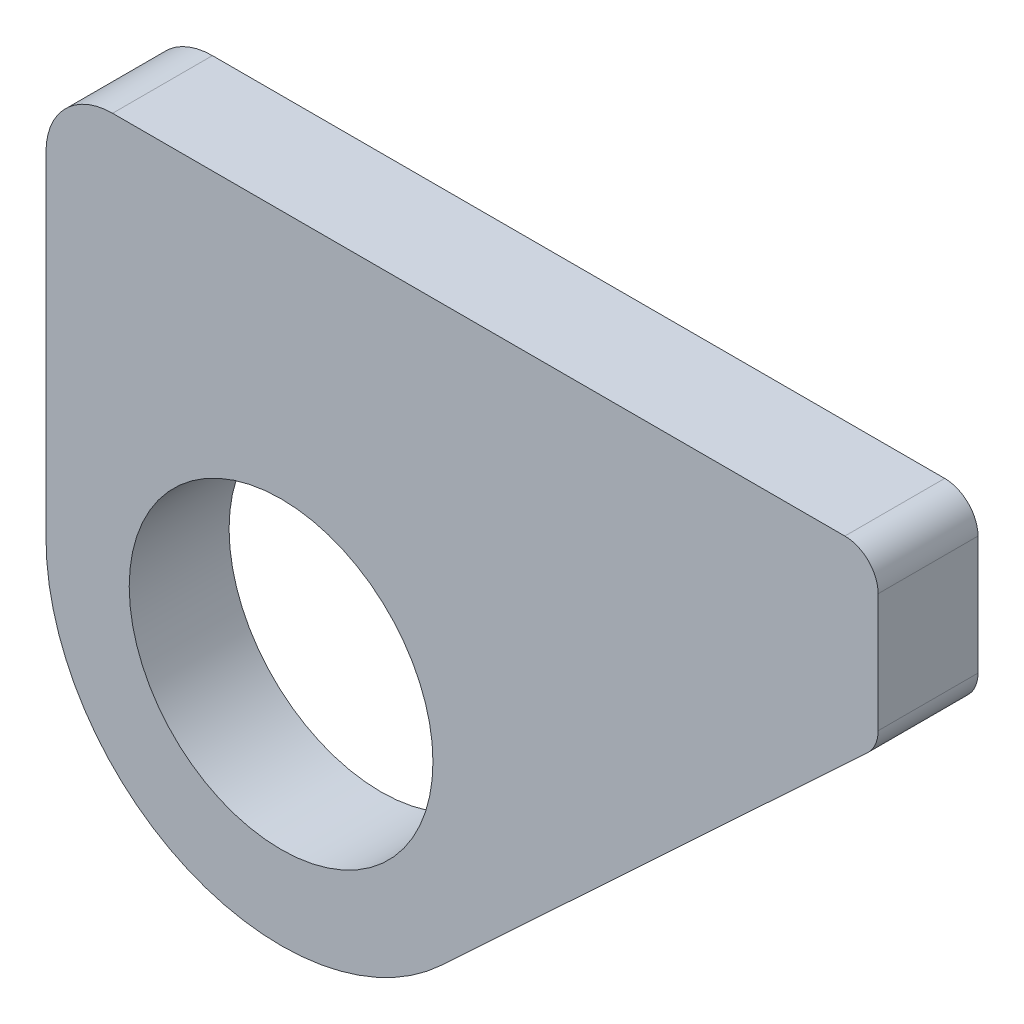
ISO-10303-21;
HEADER;
FILE_DESCRIPTION(('STEP AP214'),'2;1');
FILE_NAME('part.step','',(''),(''),'','','');
FILE_SCHEMA(('AUTOMOTIVE_DESIGN { 1 0 10303 214 1 1 1 1 }'));
ENDSEC;
DATA;
#1=APPLICATION_CONTEXT('core data for automotive mechanical design processes');
#2=APPLICATION_PROTOCOL_DEFINITION('international standard','automotive_design',2000,#1);
#3=PRODUCT_CONTEXT('',#1,'mechanical');
#4=PRODUCT('Part','Part','',(#3));
#5=PRODUCT_RELATED_PRODUCT_CATEGORY('part','',(#4));
#6=PRODUCT_DEFINITION_FORMATION('','',#4);
#7=PRODUCT_DEFINITION_CONTEXT('part definition',#1,'design');
#8=PRODUCT_DEFINITION('design','',#6,#7);
#9=PRODUCT_DEFINITION_SHAPE('','',#8);
#10=(LENGTH_UNIT() NAMED_UNIT(*) SI_UNIT(.MILLI.,.METRE.));
#11=(NAMED_UNIT(*) PLANE_ANGLE_UNIT() SI_UNIT($,.RADIAN.));
#12=(NAMED_UNIT(*) SI_UNIT($,.STERADIAN.) SOLID_ANGLE_UNIT());
#13=UNCERTAINTY_MEASURE_WITH_UNIT(LENGTH_MEASURE(1.E-05),#10,'distance_accuracy_value','');
#14=(GEOMETRIC_REPRESENTATION_CONTEXT(3) GLOBAL_UNCERTAINTY_ASSIGNED_CONTEXT((#13)) GLOBAL_UNIT_ASSIGNED_CONTEXT((#10,
#11,#12)) REPRESENTATION_CONTEXT('',''));
#15=CARTESIAN_POINT('',(0.,0.,0.));
#16=DIRECTION('',(0.,0.,1.));
#17=DIRECTION('',(1.,0.,0.));
#18=AXIS2_PLACEMENT_3D('',#15,#16,#17);
#19=CARTESIAN_POINT('',(108.051164310717,0.,3.));
#20=DIRECTION('',(-1.,0.,0.));
#21=DIRECTION('',(0.,0.,1.));
#22=AXIS2_PLACEMENT_3D('',#19,#20,#21);
#23=PLANE('',#22);
#24=DIRECTION('',(0.,1.,0.));
#25=VECTOR('',#24,1.);
#26=CARTESIAN_POINT('',(108.051164310717,0.,3.));
#27=LINE('',#26,#25);
#28=CARTESIAN_POINT('',(108.051164310717,46.3379588594764,3.));
#29=VERTEX_POINT('',#28);
#30=CARTESIAN_POINT('',(108.051164310717,56.4004588594764,3.));
#31=VERTEX_POINT('',#30);
#32=EDGE_CURVE('E114',#29,#31,#27,.T.);
#33=ORIENTED_EDGE('',*,*,#32,.T.);
#34=DIRECTION('',(0.,0.,-1.));
#35=VECTOR('',#34,1.);
#36=CARTESIAN_POINT('',(108.051164310717,56.4004588594764,3.));
#37=LINE('',#36,#35);
#38=CARTESIAN_POINT('',(108.051164310717,56.4004588594764,0.));
#39=VERTEX_POINT('',#38);
#40=EDGE_CURVE('E122',#31,#39,#37,.T.);
#41=ORIENTED_EDGE('',*,*,#40,.T.);
#42=DIRECTION('',(0.,1.,0.));
#43=VECTOR('',#42,1.);
#44=CARTESIAN_POINT('',(108.051164310717,0.,0.));
#45=LINE('',#44,#43);
#46=CARTESIAN_POINT('',(108.051164310717,46.3379588594764,0.));
#47=VERTEX_POINT('',#46);
#48=EDGE_CURVE('E117',#47,#39,#45,.T.);
#49=ORIENTED_EDGE('',*,*,#48,.F.);
#50=DIRECTION('',(0.,0.,-1.));
#51=VECTOR('',#50,1.);
#52=CARTESIAN_POINT('',(108.051164310717,46.3379588594764,3.));
#53=LINE('',#52,#51);
#54=EDGE_CURVE('E110',#29,#47,#53,.T.);
#55=ORIENTED_EDGE('',*,*,#54,.F.);
#56=EDGE_LOOP('',(#33,#41,#49,#55));
#57=FACE_BOUND('',#56,.T.);
#58=ADVANCED_FACE('F41',(#57),#23,.T.);
#59=CARTESIAN_POINT('',(115.113664310717,46.3379588594764,3.));
#60=DIRECTION('',(0.,0.,-1.));
#61=DIRECTION('',(-1.,0.,0.));
#62=AXIS2_PLACEMENT_3D('',#59,#60,#61);
#63=CYLINDRICAL_SURFACE('',#62,7.0625);
#64=CARTESIAN_POINT('',(115.113664310717,46.3379588594764,0.));
#65=DIRECTION('',(0.,0.,1.));
#66=DIRECTION('',(1.,0.,0.));
#67=AXIS2_PLACEMENT_3D('',#64,#65,#66);
#68=CIRCLE('',#67,7.0625);
#69=CARTESIAN_POINT('',(119.928647545597,41.1712536523036,0.));
#70=VERTEX_POINT('',#69);
#71=EDGE_CURVE('E160',#47,#70,#68,.T.);
#72=ORIENTED_EDGE('',*,*,#71,.T.);
#73=DIRECTION('',(0.,0.,-1.));
#74=VECTOR('',#73,1.);
#75=CARTESIAN_POINT('',(119.928647545597,41.1712536523036,3.));
#76=LINE('',#75,#74);
#77=CARTESIAN_POINT('',(119.928647545597,41.1712536523036,3.));
#78=VERTEX_POINT('',#77);
#79=EDGE_CURVE('E123',#78,#70,#76,.T.);
#80=ORIENTED_EDGE('',*,*,#79,.F.);
#81=CARTESIAN_POINT('',(115.113664310717,46.3379588594764,3.));
#82=DIRECTION('',(0.,0.,1.));
#83=DIRECTION('',(1.,0.,0.));
#84=AXIS2_PLACEMENT_3D('',#81,#82,#83);
#85=CIRCLE('',#84,7.0625);
#86=EDGE_CURVE('E127',#29,#78,#85,.T.);
#87=ORIENTED_EDGE('',*,*,#86,.F.);
#88=ORIENTED_EDGE('',*,*,#54,.T.);
#89=EDGE_LOOP('',(#72,#80,#87,#88));
#90=FACE_BOUND('',#89,.T.);
#91=ADVANCED_FACE('F128',(#90),#63,.T.);
#92=CARTESIAN_POINT('',(35.2091010356921,-37.781034073636,3.));
#93=DIRECTION('',(0.681767537682102,-0.731568878891717,0.));
#94=DIRECTION('',(0.731568878891717,0.681767537682102,0.));
#95=AXIS2_PLACEMENT_3D('',#92,#93,#94);
#96=PLANE('',#95);
#97=DIRECTION('',(-0.731568878891717,-0.681767537682102,0.));
#98=VECTOR('',#97,1.);
#99=CARTESIAN_POINT('',(35.2091010356921,-37.781034073636,0.));
#100=LINE('',#99,#98);
#101=CARTESIAN_POINT('',(132.732931848399,53.1038899805846,0.));
#102=VERTEX_POINT('',#101);
#103=EDGE_CURVE('E163',#102,#70,#100,.T.);
#104=ORIENTED_EDGE('',*,*,#103,.F.);
#105=DIRECTION('',(0.,0.,-1.));
#106=VECTOR('',#105,1.);
#107=CARTESIAN_POINT('',(132.732931848399,53.1038899805846,3.));
#108=LINE('',#107,#106);
#109=CARTESIAN_POINT('',(132.732931848399,53.1038899805846,3.));
#110=VERTEX_POINT('',#109);
#111=EDGE_CURVE('E65',#102,#110,#108,.F.);
#112=ORIENTED_EDGE('',*,*,#111,.T.);
#113=DIRECTION('',(-0.731568878891717,-0.681767537682102,0.));
#114=VECTOR('',#113,1.);
#115=CARTESIAN_POINT('',(35.2091010356921,-37.781034073636,3.));
#116=LINE('',#115,#114);
#117=EDGE_CURVE('E131',#110,#78,#116,.T.);
#118=ORIENTED_EDGE('',*,*,#117,.T.);
#119=ORIENTED_EDGE('',*,*,#79,.T.);
#120=EDGE_LOOP('',(#104,#112,#118,#119));
#121=FACE_BOUND('',#120,.T.);
#122=ADVANCED_FACE('F213',(#121),#96,.T.);
#123=CARTESIAN_POINT('',(133.051164310717,0.,3.));
#124=DIRECTION('',(1.,0.,0.));
#125=DIRECTION('',(0.,0.,-1.));
#126=AXIS2_PLACEMENT_3D('',#123,#124,#125);
#127=PLANE('',#126);
#128=DIRECTION('',(0.,-1.,0.));
#129=VECTOR('',#128,1.);
#130=CARTESIAN_POINT('',(133.051164310717,0.,3.));
#131=LINE('',#130,#129);
#132=CARTESIAN_POINT('',(133.051164310717,57.4004588594764,3.));
#133=VERTEX_POINT('',#132);
#134=CARTESIAN_POINT('',(133.051164310717,53.8354588594764,3.));
#135=VERTEX_POINT('',#134);
#136=EDGE_CURVE('E147',#133,#135,#131,.T.);
#137=ORIENTED_EDGE('',*,*,#136,.T.);
#138=DIRECTION('',(0.,0.,-1.));
#139=VECTOR('',#138,1.);
#140=CARTESIAN_POINT('',(133.051164310717,53.8354588594764,3.));
#141=LINE('',#140,#139);
#142=CARTESIAN_POINT('',(133.051164310717,53.8354588594764,0.));
#143=VERTEX_POINT('',#142);
#144=EDGE_CURVE('E188',#135,#143,#141,.T.);
#145=ORIENTED_EDGE('',*,*,#144,.T.);
#146=DIRECTION('',(0.,-1.,0.));
#147=VECTOR('',#146,1.);
#148=CARTESIAN_POINT('',(133.051164310717,0.,0.));
#149=LINE('',#148,#147);
#150=CARTESIAN_POINT('',(133.051164310717,57.4004588594764,0.));
#151=VERTEX_POINT('',#150);
#152=EDGE_CURVE('E166',#151,#143,#149,.T.);
#153=ORIENTED_EDGE('',*,*,#152,.F.);
#154=DIRECTION('',(0.,0.,-1.));
#155=VECTOR('',#154,1.);
#156=CARTESIAN_POINT('',(133.051164310717,57.4004588594764,3.));
#157=LINE('',#156,#155);
#158=EDGE_CURVE('E185',#151,#133,#157,.F.);
#159=ORIENTED_EDGE('',*,*,#158,.T.);
#160=EDGE_LOOP('',(#137,#145,#153,#159));
#161=FACE_BOUND('',#160,.T.);
#162=ADVANCED_FACE('F206',(#161),#127,.T.);
#163=CARTESIAN_POINT('',(0.,58.4004588594764,3.));
#164=DIRECTION('',(0.,1.,0.));
#165=DIRECTION('',(-1.,0.,0.));
#166=AXIS2_PLACEMENT_3D('',#163,#164,#165);
#167=PLANE('',#166);
#168=DIRECTION('',(1.,0.,0.));
#169=VECTOR('',#168,1.);
#170=CARTESIAN_POINT('',(0.,58.4004588594764,3.));
#171=LINE('',#170,#169);
#172=CARTESIAN_POINT('',(110.051164310717,58.4004588594764,3.));
#173=VERTEX_POINT('',#172);
#174=CARTESIAN_POINT('',(132.051164310717,58.4004588594764,3.));
#175=VERTEX_POINT('',#174);
#176=EDGE_CURVE('E151',#173,#175,#171,.T.);
#177=ORIENTED_EDGE('',*,*,#176,.T.);
#178=DIRECTION('',(0.,0.,-1.));
#179=VECTOR('',#178,1.);
#180=CARTESIAN_POINT('',(132.051164310717,58.4004588594764,3.));
#181=LINE('',#180,#179);
#182=CARTESIAN_POINT('',(132.051164310717,58.4004588594764,0.));
#183=VERTEX_POINT('',#182);
#184=EDGE_CURVE('E11',#175,#183,#181,.T.);
#185=ORIENTED_EDGE('',*,*,#184,.T.);
#186=DIRECTION('',(1.,0.,0.));
#187=VECTOR('',#186,1.);
#188=CARTESIAN_POINT('',(0.,58.4004588594764,0.));
#189=LINE('',#188,#187);
#190=CARTESIAN_POINT('',(110.051164310717,58.4004588594764,0.));
#191=VERTEX_POINT('',#190);
#192=EDGE_CURVE('E142',#191,#183,#189,.T.);
#193=ORIENTED_EDGE('',*,*,#192,.F.);
#194=DIRECTION('',(0.,0.,-1.));
#195=VECTOR('',#194,1.);
#196=CARTESIAN_POINT('',(110.051164310717,58.4004588594764,3.));
#197=LINE('',#196,#195);
#198=EDGE_CURVE('E180',#191,#173,#197,.F.);
#199=ORIENTED_EDGE('',*,*,#198,.T.);
#200=EDGE_LOOP('',(#177,#185,#193,#199));
#201=FACE_BOUND('',#200,.T.);
#202=ADVANCED_FACE('F218',(#201),#167,.T.);
#203=CARTESIAN_POINT('',(115.113664310717,46.3379588594764,3.));
#204=DIRECTION('',(0.,0.,-1.));
#205=DIRECTION('',(-1.,0.,0.));
#206=AXIS2_PLACEMENT_3D('',#203,#204,#205);
#207=CYLINDRICAL_SURFACE('',#206,4.56249999999999);
#208=CARTESIAN_POINT('',(115.113664310717,46.3379588594764,3.));
#209=DIRECTION('',(0.,0.,1.));
#210=DIRECTION('',(1.,0.,0.));
#211=AXIS2_PLACEMENT_3D('',#208,#209,#210);
#212=CIRCLE('',#211,4.56249999999999);
#213=CARTESIAN_POINT('',(119.676164310717,46.3379588594764,3.));
#214=VERTEX_POINT('',#213);
#215=EDGE_CURVE('E154',#214,#214,#212,.T.);
#216=ORIENTED_EDGE('',*,*,#215,.T.);
#217=EDGE_LOOP('',(#216));
#218=FACE_BOUND('',#217,.T.);
#219=CARTESIAN_POINT('',(115.113664310717,46.3379588594764,0.));
#220=DIRECTION('',(0.,0.,1.));
#221=DIRECTION('',(1.,0.,0.));
#222=AXIS2_PLACEMENT_3D('',#219,#220,#221);
#223=CIRCLE('',#222,4.56249999999999);
#224=CARTESIAN_POINT('',(119.676164310717,46.3379588594764,0.));
#225=VERTEX_POINT('',#224);
#226=EDGE_CURVE('E138',#225,#225,#223,.T.);
#227=ORIENTED_EDGE('',*,*,#226,.F.);
#228=EDGE_LOOP('',(#227));
#229=FACE_BOUND('',#228,.T.);
#230=ADVANCED_FACE('F241',(#218,#229),#207,.F.);
#231=CARTESIAN_POINT('',(0.,0.,3.));
#232=DIRECTION('',(0.,0.,1.));
#233=DIRECTION('',(1.,0.,0.));
#234=AXIS2_PLACEMENT_3D('',#231,#232,#233);
#235=PLANE('',#234);
#236=ORIENTED_EDGE('',*,*,#117,.F.);
#237=CARTESIAN_POINT('',(132.051164310717,53.8354588594764,3.));
#238=DIRECTION('',(0.,0.,1.));
#239=DIRECTION('',(1.,0.,0.));
#240=AXIS2_PLACEMENT_3D('',#237,#238,#239);
#241=CIRCLE('',#240,1.);
#242=EDGE_CURVE('E50',#110,#135,#241,.T.);
#243=ORIENTED_EDGE('',*,*,#242,.T.);
#244=ORIENTED_EDGE('',*,*,#136,.F.);
#245=CARTESIAN_POINT('',(132.051164310717,57.4004588594764,3.));
#246=DIRECTION('',(0.,0.,1.));
#247=DIRECTION('',(1.,0.,0.));
#248=AXIS2_PLACEMENT_3D('',#245,#246,#247);
#249=CIRCLE('',#248,1.);
#250=EDGE_CURVE('E57',#133,#175,#249,.T.);
#251=ORIENTED_EDGE('',*,*,#250,.T.);
#252=ORIENTED_EDGE('',*,*,#176,.F.);
#253=CARTESIAN_POINT('',(110.051164310717,56.4004588594764,3.));
#254=DIRECTION('',(0.,0.,1.));
#255=DIRECTION('',(1.,0.,0.));
#256=AXIS2_PLACEMENT_3D('',#253,#254,#255);
#257=CIRCLE('',#256,2.);
#258=EDGE_CURVE('E136',#173,#31,#257,.T.);
#259=ORIENTED_EDGE('',*,*,#258,.T.);
#260=ORIENTED_EDGE('',*,*,#32,.F.);
#261=ORIENTED_EDGE('',*,*,#86,.T.);
#262=EDGE_LOOP('',(#236,#243,#244,#251,#252,#259,#260,#261));
#263=FACE_BOUND('',#262,.T.);
#264=ORIENTED_EDGE('',*,*,#215,.F.);
#265=EDGE_LOOP('',(#264));
#266=FACE_BOUND('',#265,.T.);
#267=ADVANCED_FACE('F133',(#263,#266),#235,.T.);
#268=CARTESIAN_POINT('',(0.,0.,0.));
#269=DIRECTION('',(0.,0.,1.));
#270=DIRECTION('',(1.,0.,0.));
#271=AXIS2_PLACEMENT_3D('',#268,#269,#270);
#272=PLANE('',#271);
#273=ORIENTED_EDGE('',*,*,#152,.T.);
#274=CARTESIAN_POINT('',(132.051164310717,53.8354588594764,0.));
#275=DIRECTION('',(0.,0.,1.));
#276=DIRECTION('',(1.,0.,0.));
#277=AXIS2_PLACEMENT_3D('',#274,#275,#276);
#278=CIRCLE('',#277,1.);
#279=EDGE_CURVE('E195',#143,#102,#278,.F.);
#280=ORIENTED_EDGE('',*,*,#279,.T.);
#281=ORIENTED_EDGE('',*,*,#103,.T.);
#282=ORIENTED_EDGE('',*,*,#71,.F.);
#283=ORIENTED_EDGE('',*,*,#48,.T.);
#284=CARTESIAN_POINT('',(110.051164310717,56.4004588594764,0.));
#285=DIRECTION('',(0.,0.,1.));
#286=DIRECTION('',(1.,0.,0.));
#287=AXIS2_PLACEMENT_3D('',#284,#285,#286);
#288=CIRCLE('',#287,2.);
#289=EDGE_CURVE('E177',#39,#191,#288,.F.);
#290=ORIENTED_EDGE('',*,*,#289,.T.);
#291=ORIENTED_EDGE('',*,*,#192,.T.);
#292=CARTESIAN_POINT('',(132.051164310717,57.4004588594764,0.));
#293=DIRECTION('',(0.,0.,1.));
#294=DIRECTION('',(1.,0.,0.));
#295=AXIS2_PLACEMENT_3D('',#292,#293,#294);
#296=CIRCLE('',#295,1.);
#297=EDGE_CURVE('E192',#183,#151,#296,.F.);
#298=ORIENTED_EDGE('',*,*,#297,.T.);
#299=EDGE_LOOP('',(#273,#280,#281,#282,#283,#290,#291,#298));
#300=FACE_BOUND('',#299,.T.);
#301=ORIENTED_EDGE('',*,*,#226,.T.);
#302=EDGE_LOOP('',(#301));
#303=FACE_BOUND('',#302,.T.);
#304=ADVANCED_FACE('F211',(#300,#303),#272,.F.);
#305=CARTESIAN_POINT('',(110.051164310717,56.4004588594764,3.));
#306=DIRECTION('',(0.,0.,-1.));
#307=DIRECTION('',(-1.,0.,0.));
#308=AXIS2_PLACEMENT_3D('',#305,#306,#307);
#309=CYLINDRICAL_SURFACE('',#308,2.);
#310=ORIENTED_EDGE('',*,*,#258,.F.);
#311=ORIENTED_EDGE('',*,*,#198,.F.);
#312=ORIENTED_EDGE('',*,*,#289,.F.);
#313=ORIENTED_EDGE('',*,*,#40,.F.);
#314=EDGE_LOOP('',(#310,#311,#312,#313));
#315=FACE_BOUND('',#314,.T.);
#316=ADVANCED_FACE('F220',(#315),#309,.T.);
#317=CARTESIAN_POINT('',(132.051164310717,53.8354588594764,3.));
#318=DIRECTION('',(0.,0.,-1.));
#319=DIRECTION('',(-1.,0.,0.));
#320=AXIS2_PLACEMENT_3D('',#317,#318,#319);
#321=CYLINDRICAL_SURFACE('',#320,1.);
#322=ORIENTED_EDGE('',*,*,#242,.F.);
#323=ORIENTED_EDGE('',*,*,#111,.F.);
#324=ORIENTED_EDGE('',*,*,#279,.F.);
#325=ORIENTED_EDGE('',*,*,#144,.F.);
#326=EDGE_LOOP('',(#322,#323,#324,#325));
#327=FACE_BOUND('',#326,.T.);
#328=ADVANCED_FACE('F209',(#327),#321,.T.);
#329=CARTESIAN_POINT('',(132.051164310717,57.4004588594764,3.));
#330=DIRECTION('',(0.,0.,-1.));
#331=DIRECTION('',(-1.,0.,0.));
#332=AXIS2_PLACEMENT_3D('',#329,#330,#331);
#333=CYLINDRICAL_SURFACE('',#332,1.);
#334=ORIENTED_EDGE('',*,*,#250,.F.);
#335=ORIENTED_EDGE('',*,*,#158,.F.);
#336=ORIENTED_EDGE('',*,*,#297,.F.);
#337=ORIENTED_EDGE('',*,*,#184,.F.);
#338=EDGE_LOOP('',(#334,#335,#336,#337));
#339=FACE_BOUND('',#338,.T.);
#340=ADVANCED_FACE('F43',(#339),#333,.T.);
#341=CLOSED_SHELL('',(#58,#91,#122,#162,#202,#230,#267,#304,#316,#328,#340));
#342=MANIFOLD_SOLID_BREP('B2',#341);
#343=ADVANCED_BREP_SHAPE_REPRESENTATION('',(#18,#342),#14);
#344=SHAPE_DEFINITION_REPRESENTATION(#9,#343);
ENDSEC;
END-ISO-10303-21;
